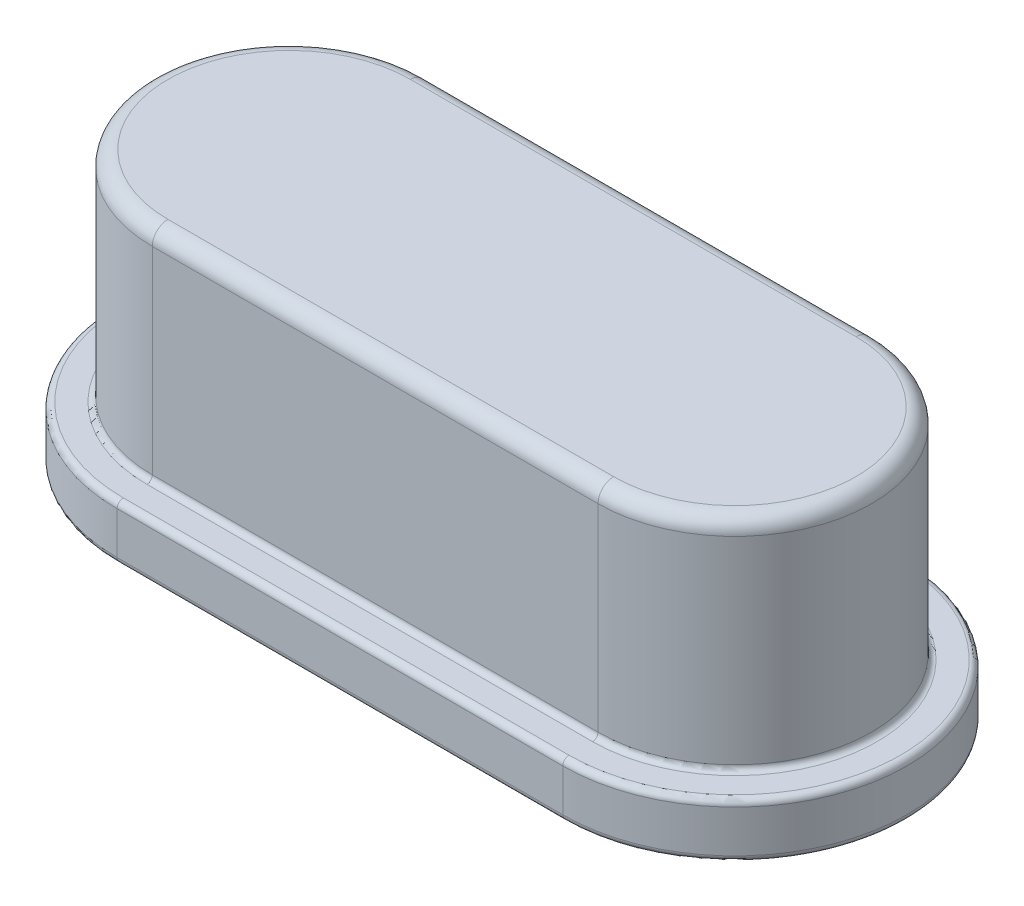
ISO-10303-21;
HEADER;
FILE_DESCRIPTION(('STEP AP214'),'2;1');
FILE_NAME('part.step','',(''),(''),'','','');
FILE_SCHEMA(('AUTOMOTIVE_DESIGN { 1 0 10303 214 1 1 1 1 }'));
ENDSEC;
DATA;
#1=APPLICATION_CONTEXT('core data for automotive mechanical design processes');
#2=APPLICATION_PROTOCOL_DEFINITION('international standard','automotive_design',2000,#1);
#3=PRODUCT_CONTEXT('',#1,'mechanical');
#4=PRODUCT('Part','Part','',(#3));
#5=PRODUCT_RELATED_PRODUCT_CATEGORY('part','',(#4));
#6=PRODUCT_DEFINITION_FORMATION('','',#4);
#7=PRODUCT_DEFINITION_CONTEXT('part definition',#1,'design');
#8=PRODUCT_DEFINITION('design','',#6,#7);
#9=PRODUCT_DEFINITION_SHAPE('','',#8);
#10=(LENGTH_UNIT() NAMED_UNIT(*) SI_UNIT(.MILLI.,.METRE.));
#11=(NAMED_UNIT(*) PLANE_ANGLE_UNIT() SI_UNIT($,.RADIAN.));
#12=(NAMED_UNIT(*) SI_UNIT($,.STERADIAN.) SOLID_ANGLE_UNIT());
#13=UNCERTAINTY_MEASURE_WITH_UNIT(LENGTH_MEASURE(1.E-05),#10,'distance_accuracy_value','');
#14=(GEOMETRIC_REPRESENTATION_CONTEXT(3) GLOBAL_UNCERTAINTY_ASSIGNED_CONTEXT((#13)) GLOBAL_UNIT_ASSIGNED_CONTEXT((#10,
#11,#12)) REPRESENTATION_CONTEXT('',''));
#15=CARTESIAN_POINT('',(0.,0.,0.));
#16=DIRECTION('',(0.,0.,1.));
#17=DIRECTION('',(1.,0.,0.));
#18=AXIS2_PLACEMENT_3D('',#15,#16,#17);
#19=CARTESIAN_POINT('',(-2.85,0.7,0.));
#20=DIRECTION('',(0.,-1.,0.));
#21=DIRECTION('',(0.,0.,-1.));
#22=AXIS2_PLACEMENT_3D('',#19,#20,#21);
#23=CYLINDRICAL_SURFACE('',#22,2.2);
#24=DIRECTION('',(0.,-1.,0.));
#25=VECTOR('',#24,1.);
#26=CARTESIAN_POINT('',(-2.85,0.7,-2.2));
#27=LINE('',#26,#25);
#28=CARTESIAN_POINT('',(-2.85,0.62,-2.2));
#29=VERTEX_POINT('',#28);
#30=CARTESIAN_POINT('',(-2.85,0.08,-2.2));
#31=VERTEX_POINT('',#30);
#32=EDGE_CURVE('E294',#29,#31,#27,.T.);
#33=ORIENTED_EDGE('',*,*,#32,.T.);
#34=CARTESIAN_POINT('',(-2.85,0.08,0.));
#35=DIRECTION('',(0.,1.,0.));
#36=DIRECTION('',(0.,0.,1.));
#37=AXIS2_PLACEMENT_3D('',#34,#35,#36);
#38=CIRCLE('',#37,2.2);
#39=CARTESIAN_POINT('',(-2.85,0.08,2.2));
#40=VERTEX_POINT('',#39);
#41=EDGE_CURVE('E194',#31,#40,#38,.T.);
#42=ORIENTED_EDGE('',*,*,#41,.T.);
#43=DIRECTION('',(0.,-1.,0.));
#44=VECTOR('',#43,1.);
#45=CARTESIAN_POINT('',(-2.85,0.7,2.2));
#46=LINE('',#45,#44);
#47=CARTESIAN_POINT('',(-2.85,0.62,2.2));
#48=VERTEX_POINT('',#47);
#49=EDGE_CURVE('E168',#48,#40,#46,.T.);
#50=ORIENTED_EDGE('',*,*,#49,.F.);
#51=CARTESIAN_POINT('',(-2.85,0.62,0.));
#52=DIRECTION('',(0.,1.,0.));
#53=DIRECTION('',(0.,0.,1.));
#54=AXIS2_PLACEMENT_3D('',#51,#52,#53);
#55=CIRCLE('',#54,2.2);
#56=EDGE_CURVE('E184',#48,#29,#55,.F.);
#57=ORIENTED_EDGE('',*,*,#56,.T.);
#58=EDGE_LOOP('',(#33,#42,#50,#57));
#59=FACE_BOUND('',#58,.T.);
#60=ADVANCED_FACE('F32',(#59),#23,.T.);
#61=CARTESIAN_POINT('',(-2.85,0.7,2.2));
#62=DIRECTION('',(0.,0.,-1.));
#63=DIRECTION('',(-1.,0.,0.));
#64=AXIS2_PLACEMENT_3D('',#61,#62,#63);
#65=PLANE('',#64);
#66=ORIENTED_EDGE('',*,*,#49,.T.);
#67=DIRECTION('',(1.,0.,0.));
#68=VECTOR('',#67,1.);
#69=CARTESIAN_POINT('',(-2.85,0.08,2.2));
#70=LINE('',#69,#68);
#71=CARTESIAN_POINT('',(2.85,0.08,2.2));
#72=VERTEX_POINT('',#71);
#73=EDGE_CURVE('E225',#40,#72,#70,.T.);
#74=ORIENTED_EDGE('',*,*,#73,.T.);
#75=DIRECTION('',(0.,-1.,0.));
#76=VECTOR('',#75,1.);
#77=CARTESIAN_POINT('',(2.85,0.7,2.2));
#78=LINE('',#77,#76);
#79=CARTESIAN_POINT('',(2.85,0.62,2.2));
#80=VERTEX_POINT('',#79);
#81=EDGE_CURVE('E306',#80,#72,#78,.T.);
#82=ORIENTED_EDGE('',*,*,#81,.F.);
#83=DIRECTION('',(1.,0.,0.));
#84=VECTOR('',#83,1.);
#85=CARTESIAN_POINT('',(-2.85,0.62,2.2));
#86=LINE('',#85,#84);
#87=EDGE_CURVE('E223',#80,#48,#86,.F.);
#88=ORIENTED_EDGE('',*,*,#87,.T.);
#89=EDGE_LOOP('',(#66,#74,#82,#88));
#90=FACE_BOUND('',#89,.T.);
#91=ADVANCED_FACE('F330',(#90),#65,.F.);
#92=CARTESIAN_POINT('',(2.85,0.7,0.));
#93=DIRECTION('',(0.,-1.,0.));
#94=DIRECTION('',(0.,0.,-1.));
#95=AXIS2_PLACEMENT_3D('',#92,#93,#94);
#96=CYLINDRICAL_SURFACE('',#95,2.2);
#97=ORIENTED_EDGE('',*,*,#81,.T.);
#98=CARTESIAN_POINT('',(2.85,0.08,0.));
#99=DIRECTION('',(0.,1.,0.));
#100=DIRECTION('',(0.,0.,1.));
#101=AXIS2_PLACEMENT_3D('',#98,#99,#100);
#102=CIRCLE('',#101,2.2);
#103=CARTESIAN_POINT('',(2.85,0.08,-2.2));
#104=VERTEX_POINT('',#103);
#105=EDGE_CURVE('E212',#72,#104,#102,.T.);
#106=ORIENTED_EDGE('',*,*,#105,.T.);
#107=DIRECTION('',(0.,-1.,0.));
#108=VECTOR('',#107,1.);
#109=CARTESIAN_POINT('',(2.85,0.7,-2.2));
#110=LINE('',#109,#108);
#111=CARTESIAN_POINT('',(2.85,0.62,-2.2));
#112=VERTEX_POINT('',#111);
#113=EDGE_CURVE('E298',#112,#104,#110,.T.);
#114=ORIENTED_EDGE('',*,*,#113,.F.);
#115=CARTESIAN_POINT('',(2.85,0.62,0.));
#116=DIRECTION('',(0.,1.,0.));
#117=DIRECTION('',(0.,0.,1.));
#118=AXIS2_PLACEMENT_3D('',#115,#116,#117);
#119=CIRCLE('',#118,2.2);
#120=EDGE_CURVE('E210',#112,#80,#119,.F.);
#121=ORIENTED_EDGE('',*,*,#120,.T.);
#122=EDGE_LOOP('',(#97,#106,#114,#121));
#123=FACE_BOUND('',#122,.T.);
#124=ADVANCED_FACE('F336',(#123),#96,.T.);
#125=CARTESIAN_POINT('',(-2.85,0.7,-2.2));
#126=DIRECTION('',(0.,0.,1.));
#127=DIRECTION('',(1.,0.,0.));
#128=AXIS2_PLACEMENT_3D('',#125,#126,#127);
#129=PLANE('',#128);
#130=ORIENTED_EDGE('',*,*,#113,.T.);
#131=DIRECTION('',(-1.,0.,0.));
#132=VECTOR('',#131,1.);
#133=CARTESIAN_POINT('',(-2.85,0.08,-2.2));
#134=LINE('',#133,#132);
#135=EDGE_CURVE('E208',#104,#31,#134,.T.);
#136=ORIENTED_EDGE('',*,*,#135,.T.);
#137=ORIENTED_EDGE('',*,*,#32,.F.);
#138=DIRECTION('',(-1.,0.,0.));
#139=VECTOR('',#138,1.);
#140=CARTESIAN_POINT('',(2.85,0.62,-2.2));
#141=LINE('',#140,#139);
#142=EDGE_CURVE('E206',#29,#112,#141,.F.);
#143=ORIENTED_EDGE('',*,*,#142,.T.);
#144=EDGE_LOOP('',(#130,#136,#137,#143));
#145=FACE_BOUND('',#144,.T.);
#146=ADVANCED_FACE('F478',(#145),#129,.F.);
#147=CARTESIAN_POINT('',(-2.85,0.7,0.));
#148=DIRECTION('',(0.,1.,0.));
#149=DIRECTION('',(0.,0.,1.));
#150=AXIS2_PLACEMENT_3D('',#147,#148,#149);
#151=PLANE('',#150);
#152=DIRECTION('',(1.,0.,0.));
#153=VECTOR('',#152,1.);
#154=CARTESIAN_POINT('',(-2.85,0.7,1.82));
#155=LINE('',#154,#153);
#156=CARTESIAN_POINT('',(2.85,0.7,1.82));
#157=VERTEX_POINT('',#156);
#158=CARTESIAN_POINT('',(-2.85,0.7,1.82));
#159=VERTEX_POINT('',#158);
#160=EDGE_CURVE('E249',#157,#159,#155,.F.);
#161=ORIENTED_EDGE('',*,*,#160,.T.);
#162=CARTESIAN_POINT('',(-2.85,0.7,0.));
#163=DIRECTION('',(0.,1.,0.));
#164=DIRECTION('',(0.,0.,1.));
#165=AXIS2_PLACEMENT_3D('',#162,#163,#164);
#166=CIRCLE('',#165,1.82);
#167=CARTESIAN_POINT('',(-2.85,0.7,-1.82));
#168=VERTEX_POINT('',#167);
#169=EDGE_CURVE('E255',#159,#168,#166,.F.);
#170=ORIENTED_EDGE('',*,*,#169,.T.);
#171=DIRECTION('',(-1.,0.,0.));
#172=VECTOR('',#171,1.);
#173=CARTESIAN_POINT('',(-2.85,0.7,-1.82));
#174=LINE('',#173,#172);
#175=CARTESIAN_POINT('',(2.85,0.7,-1.82));
#176=VERTEX_POINT('',#175);
#177=EDGE_CURVE('E253',#168,#176,#174,.F.);
#178=ORIENTED_EDGE('',*,*,#177,.T.);
#179=CARTESIAN_POINT('',(2.85,0.7,0.));
#180=DIRECTION('',(0.,1.,0.));
#181=DIRECTION('',(0.,0.,1.));
#182=AXIS2_PLACEMENT_3D('',#179,#180,#181);
#183=CIRCLE('',#182,1.82);
#184=EDGE_CURVE('E251',#176,#157,#183,.F.);
#185=ORIENTED_EDGE('',*,*,#184,.T.);
#186=EDGE_LOOP('',(#161,#170,#178,#185));
#187=FACE_BOUND('',#186,.T.);
#188=DIRECTION('',(-1.,0.,0.));
#189=VECTOR('',#188,1.);
#190=CARTESIAN_POINT('',(-2.85,0.7,-2.12));
#191=LINE('',#190,#189);
#192=CARTESIAN_POINT('',(2.85,0.7,-2.12));
#193=VERTEX_POINT('',#192);
#194=CARTESIAN_POINT('',(-2.85,0.7,-2.12));
#195=VERTEX_POINT('',#194);
#196=EDGE_CURVE('E218',#193,#195,#191,.T.);
#197=ORIENTED_EDGE('',*,*,#196,.T.);
#198=CARTESIAN_POINT('',(-2.85,0.7,0.));
#199=DIRECTION('',(0.,1.,0.));
#200=DIRECTION('',(0.,0.,1.));
#201=AXIS2_PLACEMENT_3D('',#198,#199,#200);
#202=CIRCLE('',#201,2.12);
#203=CARTESIAN_POINT('',(-2.85,0.7,2.12));
#204=VERTEX_POINT('',#203);
#205=EDGE_CURVE('E220',#195,#204,#202,.T.);
#206=ORIENTED_EDGE('',*,*,#205,.T.);
#207=DIRECTION('',(1.,0.,0.));
#208=VECTOR('',#207,1.);
#209=CARTESIAN_POINT('',(2.85,0.7,2.12));
#210=LINE('',#209,#208);
#211=CARTESIAN_POINT('',(2.85,0.7,2.12));
#212=VERTEX_POINT('',#211);
#213=EDGE_CURVE('E214',#204,#212,#210,.T.);
#214=ORIENTED_EDGE('',*,*,#213,.T.);
#215=CARTESIAN_POINT('',(2.85,0.7,0.));
#216=DIRECTION('',(0.,1.,0.));
#217=DIRECTION('',(0.,0.,1.));
#218=AXIS2_PLACEMENT_3D('',#215,#216,#217);
#219=CIRCLE('',#218,2.12);
#220=EDGE_CURVE('E216',#212,#193,#219,.T.);
#221=ORIENTED_EDGE('',*,*,#220,.T.);
#222=EDGE_LOOP('',(#197,#206,#214,#221));
#223=FACE_BOUND('',#222,.T.);
#224=ADVANCED_FACE('F279',(#187,#223),#151,.T.);
#225=CARTESIAN_POINT('',(-2.85,0.,0.));
#226=DIRECTION('',(0.,1.,0.));
#227=DIRECTION('',(0.,0.,1.));
#228=AXIS2_PLACEMENT_3D('',#225,#226,#227);
#229=PLANE('',#228);
#230=DIRECTION('',(1.,0.,0.));
#231=VECTOR('',#230,1.);
#232=CARTESIAN_POINT('',(-2.85,0.,2.12));
#233=LINE('',#232,#231);
#234=CARTESIAN_POINT('',(2.85,0.,2.12));
#235=VERTEX_POINT('',#234);
#236=CARTESIAN_POINT('',(-2.85,0.,2.12));
#237=VERTEX_POINT('',#236);
#238=EDGE_CURVE('E197',#235,#237,#233,.F.);
#239=ORIENTED_EDGE('',*,*,#238,.T.);
#240=CARTESIAN_POINT('',(-2.85,0.,0.));
#241=DIRECTION('',(0.,1.,0.));
#242=DIRECTION('',(0.,0.,1.));
#243=AXIS2_PLACEMENT_3D('',#240,#241,#242);
#244=CIRCLE('',#243,2.12);
#245=CARTESIAN_POINT('',(-2.85,0.,-2.12));
#246=VERTEX_POINT('',#245);
#247=EDGE_CURVE('E203',#237,#246,#244,.F.);
#248=ORIENTED_EDGE('',*,*,#247,.T.);
#249=DIRECTION('',(-1.,0.,0.));
#250=VECTOR('',#249,1.);
#251=CARTESIAN_POINT('',(-2.85,0.,-2.12));
#252=LINE('',#251,#250);
#253=CARTESIAN_POINT('',(2.85,0.,-2.12));
#254=VERTEX_POINT('',#253);
#255=EDGE_CURVE('E201',#246,#254,#252,.F.);
#256=ORIENTED_EDGE('',*,*,#255,.T.);
#257=CARTESIAN_POINT('',(2.85,0.,0.));
#258=DIRECTION('',(0.,1.,0.));
#259=DIRECTION('',(0.,0.,1.));
#260=AXIS2_PLACEMENT_3D('',#257,#258,#259);
#261=CIRCLE('',#260,2.12);
#262=EDGE_CURVE('E199',#254,#235,#261,.F.);
#263=ORIENTED_EDGE('',*,*,#262,.T.);
#264=EDGE_LOOP('',(#239,#248,#256,#263));
#265=FACE_BOUND('',#264,.T.);
#266=ADVANCED_FACE('F468',(#265),#229,.F.);
#267=CARTESIAN_POINT('',(-2.85,3.5,0.));
#268=DIRECTION('',(0.,-1.,0.));
#269=DIRECTION('',(0.,0.,-1.));
#270=AXIS2_PLACEMENT_3D('',#267,#268,#269);
#271=CYLINDRICAL_SURFACE('',#270,1.75);
#272=DIRECTION('',(0.,-1.,0.));
#273=VECTOR('',#272,1.);
#274=CARTESIAN_POINT('',(-2.85,3.5,-1.75));
#275=LINE('',#274,#273);
#276=CARTESIAN_POINT('',(-2.85,3.3,-1.75));
#277=VERTEX_POINT('',#276);
#278=CARTESIAN_POINT('',(-2.85,0.77,-1.75));
#279=VERTEX_POINT('',#278);
#280=EDGE_CURVE('E191',#277,#279,#275,.T.);
#281=ORIENTED_EDGE('',*,*,#280,.T.);
#282=CARTESIAN_POINT('',(-2.85,0.77,0.));
#283=DIRECTION('',(0.,1.,0.));
#284=DIRECTION('',(0.,0.,1.));
#285=AXIS2_PLACEMENT_3D('',#282,#283,#284);
#286=CIRCLE('',#285,1.75);
#287=CARTESIAN_POINT('',(-2.85,0.77,1.75));
#288=VERTEX_POINT('',#287);
#289=EDGE_CURVE('E227',#279,#288,#286,.T.);
#290=ORIENTED_EDGE('',*,*,#289,.T.);
#291=DIRECTION('',(0.,-1.,0.));
#292=VECTOR('',#291,1.);
#293=CARTESIAN_POINT('',(-2.85,3.5,1.75));
#294=LINE('',#293,#292);
#295=CARTESIAN_POINT('',(-2.85,3.3,1.75));
#296=VERTEX_POINT('',#295);
#297=EDGE_CURVE('E291',#296,#288,#294,.T.);
#298=ORIENTED_EDGE('',*,*,#297,.F.);
#299=CARTESIAN_POINT('',(-2.85,3.3,0.));
#300=DIRECTION('',(0.,1.,0.));
#301=DIRECTION('',(0.,0.,1.));
#302=AXIS2_PLACEMENT_3D('',#299,#300,#301);
#303=CIRCLE('',#302,1.75);
#304=EDGE_CURVE('E154',#296,#277,#303,.F.);
#305=ORIENTED_EDGE('',*,*,#304,.T.);
#306=EDGE_LOOP('',(#281,#290,#298,#305));
#307=FACE_BOUND('',#306,.T.);
#308=ADVANCED_FACE('F290',(#307),#271,.T.);
#309=CARTESIAN_POINT('',(-2.85,3.5,1.75));
#310=DIRECTION('',(0.,0.,-1.));
#311=DIRECTION('',(-1.,0.,0.));
#312=AXIS2_PLACEMENT_3D('',#309,#310,#311);
#313=PLANE('',#312);
#314=ORIENTED_EDGE('',*,*,#297,.T.);
#315=DIRECTION('',(1.,0.,0.));
#316=VECTOR('',#315,1.);
#317=CARTESIAN_POINT('',(-2.85,0.77,1.75));
#318=LINE('',#317,#316);
#319=CARTESIAN_POINT('',(2.85,0.77,1.75));
#320=VERTEX_POINT('',#319);
#321=EDGE_CURVE('E11',#288,#320,#318,.T.);
#322=ORIENTED_EDGE('',*,*,#321,.T.);
#323=DIRECTION('',(0.,-1.,0.));
#324=VECTOR('',#323,1.);
#325=CARTESIAN_POINT('',(2.85,3.5,1.75));
#326=LINE('',#325,#324);
#327=CARTESIAN_POINT('',(2.85,3.3,1.75));
#328=VERTEX_POINT('',#327);
#329=EDGE_CURVE('E295',#328,#320,#326,.T.);
#330=ORIENTED_EDGE('',*,*,#329,.F.);
#331=DIRECTION('',(1.,0.,0.));
#332=VECTOR('',#331,1.);
#333=CARTESIAN_POINT('',(-2.85,3.3,1.75));
#334=LINE('',#333,#332);
#335=EDGE_CURVE('E183',#328,#296,#334,.F.);
#336=ORIENTED_EDGE('',*,*,#335,.T.);
#337=EDGE_LOOP('',(#314,#322,#330,#336));
#338=FACE_BOUND('',#337,.T.);
#339=ADVANCED_FACE('F293',(#338),#313,.F.);
#340=CARTESIAN_POINT('',(2.85,3.5,0.));
#341=DIRECTION('',(0.,-1.,0.));
#342=DIRECTION('',(0.,0.,-1.));
#343=AXIS2_PLACEMENT_3D('',#340,#341,#342);
#344=CYLINDRICAL_SURFACE('',#343,1.75);
#345=ORIENTED_EDGE('',*,*,#329,.T.);
#346=CARTESIAN_POINT('',(2.85,0.77,0.));
#347=DIRECTION('',(0.,1.,0.));
#348=DIRECTION('',(0.,0.,1.));
#349=AXIS2_PLACEMENT_3D('',#346,#347,#348);
#350=CIRCLE('',#349,1.75);
#351=CARTESIAN_POINT('',(2.85,0.77,-1.75));
#352=VERTEX_POINT('',#351);
#353=EDGE_CURVE('E41',#320,#352,#350,.T.);
#354=ORIENTED_EDGE('',*,*,#353,.T.);
#355=DIRECTION('',(0.,-1.,0.));
#356=VECTOR('',#355,1.);
#357=CARTESIAN_POINT('',(2.85,3.5,-1.75));
#358=LINE('',#357,#356);
#359=CARTESIAN_POINT('',(2.85,3.3,-1.75));
#360=VERTEX_POINT('',#359);
#361=EDGE_CURVE('E300',#360,#352,#358,.T.);
#362=ORIENTED_EDGE('',*,*,#361,.F.);
#363=CARTESIAN_POINT('',(2.85,3.3,0.));
#364=DIRECTION('',(0.,1.,0.));
#365=DIRECTION('',(0.,0.,1.));
#366=AXIS2_PLACEMENT_3D('',#363,#364,#365);
#367=CIRCLE('',#366,1.75);
#368=EDGE_CURVE('E181',#360,#328,#367,.F.);
#369=ORIENTED_EDGE('',*,*,#368,.T.);
#370=EDGE_LOOP('',(#345,#354,#362,#369));
#371=FACE_BOUND('',#370,.T.);
#372=ADVANCED_FACE('F320',(#371),#344,.T.);
#373=CARTESIAN_POINT('',(-2.85,3.5,-1.75));
#374=DIRECTION('',(0.,0.,1.));
#375=DIRECTION('',(1.,0.,0.));
#376=AXIS2_PLACEMENT_3D('',#373,#374,#375);
#377=PLANE('',#376);
#378=ORIENTED_EDGE('',*,*,#361,.T.);
#379=DIRECTION('',(-1.,0.,0.));
#380=VECTOR('',#379,1.);
#381=CARTESIAN_POINT('',(-2.85,0.77,-1.75));
#382=LINE('',#381,#380);
#383=EDGE_CURVE('E258',#352,#279,#382,.T.);
#384=ORIENTED_EDGE('',*,*,#383,.T.);
#385=ORIENTED_EDGE('',*,*,#280,.F.);
#386=DIRECTION('',(-1.,0.,0.));
#387=VECTOR('',#386,1.);
#388=CARTESIAN_POINT('',(2.85,3.3,-1.75));
#389=LINE('',#388,#387);
#390=EDGE_CURVE('E175',#277,#360,#389,.F.);
#391=ORIENTED_EDGE('',*,*,#390,.T.);
#392=EDGE_LOOP('',(#378,#384,#385,#391));
#393=FACE_BOUND('',#392,.T.);
#394=ADVANCED_FACE('F318',(#393),#377,.F.);
#395=CARTESIAN_POINT('',(-2.85,3.5,0.));
#396=DIRECTION('',(0.,1.,0.));
#397=DIRECTION('',(0.,0.,1.));
#398=AXIS2_PLACEMENT_3D('',#395,#396,#397);
#399=PLANE('',#398);
#400=DIRECTION('',(-1.,0.,0.));
#401=VECTOR('',#400,1.);
#402=CARTESIAN_POINT('',(-2.85,3.5,-1.55));
#403=LINE('',#402,#401);
#404=CARTESIAN_POINT('',(2.85,3.5,-1.55));
#405=VERTEX_POINT('',#404);
#406=CARTESIAN_POINT('',(-2.85,3.5,-1.55));
#407=VERTEX_POINT('',#406);
#408=EDGE_CURVE('E172',#405,#407,#403,.T.);
#409=ORIENTED_EDGE('',*,*,#408,.T.);
#410=CARTESIAN_POINT('',(-2.85,3.5,0.));
#411=DIRECTION('',(0.,1.,0.));
#412=DIRECTION('',(0.,0.,1.));
#413=AXIS2_PLACEMENT_3D('',#410,#411,#412);
#414=CIRCLE('',#413,1.55);
#415=CARTESIAN_POINT('',(-2.85,3.5,1.55));
#416=VERTEX_POINT('',#415);
#417=EDGE_CURVE('E152',#407,#416,#414,.T.);
#418=ORIENTED_EDGE('',*,*,#417,.T.);
#419=DIRECTION('',(1.,0.,0.));
#420=VECTOR('',#419,1.);
#421=CARTESIAN_POINT('',(2.85,3.5,1.55));
#422=LINE('',#421,#420);
#423=CARTESIAN_POINT('',(2.85,3.5,1.55));
#424=VERTEX_POINT('',#423);
#425=EDGE_CURVE('E161',#416,#424,#422,.T.);
#426=ORIENTED_EDGE('',*,*,#425,.T.);
#427=CARTESIAN_POINT('',(2.85,3.5,0.));
#428=DIRECTION('',(0.,1.,0.));
#429=DIRECTION('',(0.,0.,1.));
#430=AXIS2_PLACEMENT_3D('',#427,#428,#429);
#431=CIRCLE('',#430,1.55);
#432=EDGE_CURVE('E167',#424,#405,#431,.T.);
#433=ORIENTED_EDGE('',*,*,#432,.T.);
#434=EDGE_LOOP('',(#409,#418,#426,#433));
#435=FACE_BOUND('',#434,.T.);
#436=ADVANCED_FACE('F170',(#435),#399,.T.);
#437=CARTESIAN_POINT('',(2.85,3.3,0.));
#438=DIRECTION('',(0.,1.,0.));
#439=DIRECTION('',(0.,0.,1.));
#440=AXIS2_PLACEMENT_3D('',#437,#438,#439);
#441=TOROIDAL_SURFACE('',#440,1.55,0.2);
#442=CARTESIAN_POINT('',(2.85,3.3,1.55));
#443=DIRECTION('',(-1.,0.,0.));
#444=DIRECTION('',(0.,0.,1.));
#445=AXIS2_PLACEMENT_3D('',#442,#443,#444);
#446=CIRCLE('',#445,0.2);
#447=EDGE_CURVE('E164',#328,#424,#446,.T.);
#448=ORIENTED_EDGE('',*,*,#447,.F.);
#449=ORIENTED_EDGE('',*,*,#368,.F.);
#450=CARTESIAN_POINT('',(2.85,3.3,-1.55));
#451=DIRECTION('',(-1.,0.,0.));
#452=DIRECTION('',(0.,0.,1.));
#453=AXIS2_PLACEMENT_3D('',#450,#451,#452);
#454=CIRCLE('',#453,0.2);
#455=EDGE_CURVE('E188',#405,#360,#454,.T.);
#456=ORIENTED_EDGE('',*,*,#455,.F.);
#457=ORIENTED_EDGE('',*,*,#432,.F.);
#458=EDGE_LOOP('',(#448,#449,#456,#457));
#459=FACE_BOUND('',#458,.T.);
#460=ADVANCED_FACE('F313',(#459),#441,.T.);
#461=CARTESIAN_POINT('',(-2.85,3.3,-1.55));
#462=DIRECTION('',(1.,0.,0.));
#463=DIRECTION('',(0.,0.,-1.));
#464=AXIS2_PLACEMENT_3D('',#461,#462,#463);
#465=CYLINDRICAL_SURFACE('',#464,0.2);
#466=ORIENTED_EDGE('',*,*,#455,.T.);
#467=ORIENTED_EDGE('',*,*,#390,.F.);
#468=CARTESIAN_POINT('',(-2.85,3.3,-1.55));
#469=DIRECTION('',(-1.,0.,0.));
#470=DIRECTION('',(0.,0.,1.));
#471=AXIS2_PLACEMENT_3D('',#468,#469,#470);
#472=CIRCLE('',#471,0.2);
#473=EDGE_CURVE('E157',#407,#277,#472,.T.);
#474=ORIENTED_EDGE('',*,*,#473,.F.);
#475=ORIENTED_EDGE('',*,*,#408,.F.);
#476=EDGE_LOOP('',(#466,#467,#474,#475));
#477=FACE_BOUND('',#476,.T.);
#478=ADVANCED_FACE('F316',(#477),#465,.T.);
#479=CARTESIAN_POINT('',(-2.85,3.3,1.55));
#480=DIRECTION('',(-1.,0.,0.));
#481=DIRECTION('',(0.,0.,1.));
#482=AXIS2_PLACEMENT_3D('',#479,#480,#481);
#483=CYLINDRICAL_SURFACE('',#482,0.2);
#484=ORIENTED_EDGE('',*,*,#447,.T.);
#485=ORIENTED_EDGE('',*,*,#425,.F.);
#486=CARTESIAN_POINT('',(-2.85,3.3,1.55));
#487=DIRECTION('',(-1.,0.,0.));
#488=DIRECTION('',(0.,0.,1.));
#489=AXIS2_PLACEMENT_3D('',#486,#487,#488);
#490=CIRCLE('',#489,0.2);
#491=EDGE_CURVE('E148',#296,#416,#490,.T.);
#492=ORIENTED_EDGE('',*,*,#491,.F.);
#493=ORIENTED_EDGE('',*,*,#335,.F.);
#494=EDGE_LOOP('',(#484,#485,#492,#493));
#495=FACE_BOUND('',#494,.T.);
#496=ADVANCED_FACE('F162',(#495),#483,.T.);
#497=CARTESIAN_POINT('',(-2.85,3.3,0.));
#498=DIRECTION('',(0.,1.,0.));
#499=DIRECTION('',(0.,0.,1.));
#500=AXIS2_PLACEMENT_3D('',#497,#498,#499);
#501=TOROIDAL_SURFACE('',#500,1.55,0.2);
#502=ORIENTED_EDGE('',*,*,#473,.T.);
#503=ORIENTED_EDGE('',*,*,#304,.F.);
#504=ORIENTED_EDGE('',*,*,#491,.T.);
#505=ORIENTED_EDGE('',*,*,#417,.F.);
#506=EDGE_LOOP('',(#502,#503,#504,#505));
#507=FACE_BOUND('',#506,.T.);
#508=ADVANCED_FACE('F150',(#507),#501,.T.);
#509=CARTESIAN_POINT('',(2.85,0.08,0.));
#510=DIRECTION('',(0.,1.,0.));
#511=DIRECTION('',(0.,0.,1.));
#512=AXIS2_PLACEMENT_3D('',#509,#510,#511);
#513=TOROIDAL_SURFACE('',#512,2.12,0.08);
#514=CARTESIAN_POINT('',(2.85,0.08,2.12));
#515=DIRECTION('',(-1.,0.,0.));
#516=DIRECTION('',(0.,0.,1.));
#517=AXIS2_PLACEMENT_3D('',#514,#515,#516);
#518=CIRCLE('',#517,0.08);
#519=EDGE_CURVE('E233',#235,#72,#518,.T.);
#520=ORIENTED_EDGE('',*,*,#519,.F.);
#521=ORIENTED_EDGE('',*,*,#262,.F.);
#522=CARTESIAN_POINT('',(2.85,0.08,-2.12));
#523=DIRECTION('',(-1.,0.,0.));
#524=DIRECTION('',(0.,0.,1.));
#525=AXIS2_PLACEMENT_3D('',#522,#523,#524);
#526=CIRCLE('',#525,0.08);
#527=EDGE_CURVE('E158',#104,#254,#526,.T.);
#528=ORIENTED_EDGE('',*,*,#527,.F.);
#529=ORIENTED_EDGE('',*,*,#105,.F.);
#530=EDGE_LOOP('',(#520,#521,#528,#529));
#531=FACE_BOUND('',#530,.T.);
#532=ADVANCED_FACE('F343',(#531),#513,.T.);
#533=CARTESIAN_POINT('',(-2.85,0.08,-2.12));
#534=DIRECTION('',(-1.,0.,0.));
#535=DIRECTION('',(0.,0.,1.));
#536=AXIS2_PLACEMENT_3D('',#533,#534,#535);
#537=CYLINDRICAL_SURFACE('',#536,0.08);
#538=ORIENTED_EDGE('',*,*,#527,.T.);
#539=ORIENTED_EDGE('',*,*,#255,.F.);
#540=CARTESIAN_POINT('',(-2.85,0.08,-2.12));
#541=DIRECTION('',(-1.,0.,0.));
#542=DIRECTION('',(0.,0.,1.));
#543=AXIS2_PLACEMENT_3D('',#540,#541,#542);
#544=CIRCLE('',#543,0.08);
#545=EDGE_CURVE('E230',#31,#246,#544,.T.);
#546=ORIENTED_EDGE('',*,*,#545,.F.);
#547=ORIENTED_EDGE('',*,*,#135,.F.);
#548=EDGE_LOOP('',(#538,#539,#546,#547));
#549=FACE_BOUND('',#548,.T.);
#550=ADVANCED_FACE('F358',(#549),#537,.T.);
#551=CARTESIAN_POINT('',(-2.85,0.08,2.12));
#552=DIRECTION('',(1.,0.,0.));
#553=DIRECTION('',(0.,0.,-1.));
#554=AXIS2_PLACEMENT_3D('',#551,#552,#553);
#555=CYLINDRICAL_SURFACE('',#554,0.08);
#556=ORIENTED_EDGE('',*,*,#519,.T.);
#557=ORIENTED_EDGE('',*,*,#73,.F.);
#558=CARTESIAN_POINT('',(-2.85,0.08,2.12));
#559=DIRECTION('',(-1.,0.,0.));
#560=DIRECTION('',(0.,0.,1.));
#561=AXIS2_PLACEMENT_3D('',#558,#559,#560);
#562=CIRCLE('',#561,0.08);
#563=EDGE_CURVE('E228',#237,#40,#562,.T.);
#564=ORIENTED_EDGE('',*,*,#563,.F.);
#565=ORIENTED_EDGE('',*,*,#238,.F.);
#566=EDGE_LOOP('',(#556,#557,#564,#565));
#567=FACE_BOUND('',#566,.T.);
#568=ADVANCED_FACE('F354',(#567),#555,.T.);
#569=CARTESIAN_POINT('',(-2.85,0.08,0.));
#570=DIRECTION('',(0.,1.,0.));
#571=DIRECTION('',(0.,0.,1.));
#572=AXIS2_PLACEMENT_3D('',#569,#570,#571);
#573=TOROIDAL_SURFACE('',#572,2.12,0.08);
#574=ORIENTED_EDGE('',*,*,#545,.T.);
#575=ORIENTED_EDGE('',*,*,#247,.F.);
#576=ORIENTED_EDGE('',*,*,#563,.T.);
#577=ORIENTED_EDGE('',*,*,#41,.F.);
#578=EDGE_LOOP('',(#574,#575,#576,#577));
#579=FACE_BOUND('',#578,.T.);
#580=ADVANCED_FACE('F350',(#579),#573,.T.);
#581=CARTESIAN_POINT('',(2.85,0.62,0.));
#582=DIRECTION('',(0.,1.,0.));
#583=DIRECTION('',(0.,0.,1.));
#584=AXIS2_PLACEMENT_3D('',#581,#582,#583);
#585=TOROIDAL_SURFACE('',#584,2.12,0.08);
#586=CARTESIAN_POINT('',(2.85,0.62,2.12));
#587=DIRECTION('',(-1.,0.,0.));
#588=DIRECTION('',(0.,0.,1.));
#589=AXIS2_PLACEMENT_3D('',#586,#587,#588);
#590=CIRCLE('',#589,0.08);
#591=EDGE_CURVE('E242',#80,#212,#590,.T.);
#592=ORIENTED_EDGE('',*,*,#591,.F.);
#593=ORIENTED_EDGE('',*,*,#120,.F.);
#594=CARTESIAN_POINT('',(2.85,0.62,-2.12));
#595=DIRECTION('',(-1.,0.,0.));
#596=DIRECTION('',(0.,0.,1.));
#597=AXIS2_PLACEMENT_3D('',#594,#595,#596);
#598=CIRCLE('',#597,0.08);
#599=EDGE_CURVE('E231',#193,#112,#598,.T.);
#600=ORIENTED_EDGE('',*,*,#599,.F.);
#601=ORIENTED_EDGE('',*,*,#220,.F.);
#602=EDGE_LOOP('',(#592,#593,#600,#601));
#603=FACE_BOUND('',#602,.T.);
#604=ADVANCED_FACE('F353',(#603),#585,.T.);
#605=CARTESIAN_POINT('',(-2.85,0.62,-2.12));
#606=DIRECTION('',(1.,0.,0.));
#607=DIRECTION('',(0.,0.,-1.));
#608=AXIS2_PLACEMENT_3D('',#605,#606,#607);
#609=CYLINDRICAL_SURFACE('',#608,0.08);
#610=ORIENTED_EDGE('',*,*,#599,.T.);
#611=ORIENTED_EDGE('',*,*,#142,.F.);
#612=CARTESIAN_POINT('',(-2.85,0.62,-2.12));
#613=DIRECTION('',(-1.,0.,0.));
#614=DIRECTION('',(0.,0.,1.));
#615=AXIS2_PLACEMENT_3D('',#612,#613,#614);
#616=CIRCLE('',#615,0.08);
#617=EDGE_CURVE('E240',#195,#29,#616,.T.);
#618=ORIENTED_EDGE('',*,*,#617,.F.);
#619=ORIENTED_EDGE('',*,*,#196,.F.);
#620=EDGE_LOOP('',(#610,#611,#618,#619));
#621=FACE_BOUND('',#620,.T.);
#622=ADVANCED_FACE('F373',(#621),#609,.T.);
#623=CARTESIAN_POINT('',(-2.85,0.62,2.12));
#624=DIRECTION('',(-1.,0.,0.));
#625=DIRECTION('',(0.,0.,1.));
#626=AXIS2_PLACEMENT_3D('',#623,#624,#625);
#627=CYLINDRICAL_SURFACE('',#626,0.08);
#628=ORIENTED_EDGE('',*,*,#591,.T.);
#629=ORIENTED_EDGE('',*,*,#213,.F.);
#630=CARTESIAN_POINT('',(-2.85,0.62,2.12));
#631=DIRECTION('',(-1.,0.,0.));
#632=DIRECTION('',(0.,0.,1.));
#633=AXIS2_PLACEMENT_3D('',#630,#631,#632);
#634=CIRCLE('',#633,0.08);
#635=EDGE_CURVE('E238',#48,#204,#634,.T.);
#636=ORIENTED_EDGE('',*,*,#635,.F.);
#637=ORIENTED_EDGE('',*,*,#87,.F.);
#638=EDGE_LOOP('',(#628,#629,#636,#637));
#639=FACE_BOUND('',#638,.T.);
#640=ADVANCED_FACE('F369',(#639),#627,.T.);
#641=CARTESIAN_POINT('',(-2.85,0.62,0.));
#642=DIRECTION('',(0.,1.,0.));
#643=DIRECTION('',(0.,0.,1.));
#644=AXIS2_PLACEMENT_3D('',#641,#642,#643);
#645=TOROIDAL_SURFACE('',#644,2.12,0.08);
#646=ORIENTED_EDGE('',*,*,#617,.T.);
#647=ORIENTED_EDGE('',*,*,#56,.F.);
#648=ORIENTED_EDGE('',*,*,#635,.T.);
#649=ORIENTED_EDGE('',*,*,#205,.F.);
#650=EDGE_LOOP('',(#646,#647,#648,#649));
#651=FACE_BOUND('',#650,.T.);
#652=ADVANCED_FACE('F366',(#651),#645,.T.);
#653=CARTESIAN_POINT('',(2.85,0.77,0.));
#654=DIRECTION('',(0.,1.,0.));
#655=DIRECTION('',(0.,0.,1.));
#656=AXIS2_PLACEMENT_3D('',#653,#654,#655);
#657=TOROIDAL_SURFACE('',#656,1.82,0.07);
#658=CARTESIAN_POINT('',(2.85,0.77,1.82));
#659=DIRECTION('',(1.,0.,0.));
#660=DIRECTION('',(0.,0.,-1.));
#661=AXIS2_PLACEMENT_3D('',#658,#659,#660);
#662=CIRCLE('',#661,0.07);
#663=EDGE_CURVE('E264',#157,#320,#662,.T.);
#664=ORIENTED_EDGE('',*,*,#663,.F.);
#665=ORIENTED_EDGE('',*,*,#184,.F.);
#666=CARTESIAN_POINT('',(2.85,0.77,-1.82));
#667=DIRECTION('',(1.,0.,0.));
#668=DIRECTION('',(0.,0.,-1.));
#669=AXIS2_PLACEMENT_3D('',#666,#667,#668);
#670=CIRCLE('',#669,0.07);
#671=EDGE_CURVE('E36',#352,#176,#670,.T.);
#672=ORIENTED_EDGE('',*,*,#671,.F.);
#673=ORIENTED_EDGE('',*,*,#353,.F.);
#674=EDGE_LOOP('',(#664,#665,#672,#673));
#675=FACE_BOUND('',#674,.T.);
#676=ADVANCED_FACE('F34',(#675),#657,.F.);
#677=CARTESIAN_POINT('',(-2.85,0.77,-1.82));
#678=DIRECTION('',(-1.,0.,0.));
#679=DIRECTION('',(0.,0.,1.));
#680=AXIS2_PLACEMENT_3D('',#677,#678,#679);
#681=CYLINDRICAL_SURFACE('',#680,0.07);
#682=ORIENTED_EDGE('',*,*,#671,.T.);
#683=ORIENTED_EDGE('',*,*,#177,.F.);
#684=CARTESIAN_POINT('',(-2.85,0.77,-1.82));
#685=DIRECTION('',(1.,0.,0.));
#686=DIRECTION('',(0.,0.,-1.));
#687=AXIS2_PLACEMENT_3D('',#684,#685,#686);
#688=CIRCLE('',#687,0.07);
#689=EDGE_CURVE('E263',#279,#168,#688,.T.);
#690=ORIENTED_EDGE('',*,*,#689,.F.);
#691=ORIENTED_EDGE('',*,*,#383,.F.);
#692=EDGE_LOOP('',(#682,#683,#690,#691));
#693=FACE_BOUND('',#692,.T.);
#694=ADVANCED_FACE('F274',(#693),#681,.F.);
#695=CARTESIAN_POINT('',(-2.85,0.77,1.82));
#696=DIRECTION('',(1.,0.,0.));
#697=DIRECTION('',(0.,0.,-1.));
#698=AXIS2_PLACEMENT_3D('',#695,#696,#697);
#699=CYLINDRICAL_SURFACE('',#698,0.07);
#700=ORIENTED_EDGE('',*,*,#663,.T.);
#701=ORIENTED_EDGE('',*,*,#321,.F.);
#702=CARTESIAN_POINT('',(-2.85,0.77,1.82));
#703=DIRECTION('',(1.,0.,0.));
#704=DIRECTION('',(0.,0.,-1.));
#705=AXIS2_PLACEMENT_3D('',#702,#703,#704);
#706=CIRCLE('',#705,0.07);
#707=EDGE_CURVE('E261',#159,#288,#706,.T.);
#708=ORIENTED_EDGE('',*,*,#707,.F.);
#709=ORIENTED_EDGE('',*,*,#160,.F.);
#710=EDGE_LOOP('',(#700,#701,#708,#709));
#711=FACE_BOUND('',#710,.T.);
#712=ADVANCED_FACE('F286',(#711),#699,.F.);
#713=CARTESIAN_POINT('',(-2.85,0.77,0.));
#714=DIRECTION('',(0.,1.,0.));
#715=DIRECTION('',(0.,0.,1.));
#716=AXIS2_PLACEMENT_3D('',#713,#714,#715);
#717=TOROIDAL_SURFACE('',#716,1.82,0.07);
#718=ORIENTED_EDGE('',*,*,#689,.T.);
#719=ORIENTED_EDGE('',*,*,#169,.F.);
#720=ORIENTED_EDGE('',*,*,#707,.T.);
#721=ORIENTED_EDGE('',*,*,#289,.F.);
#722=EDGE_LOOP('',(#718,#719,#720,#721));
#723=FACE_BOUND('',#722,.T.);
#724=ADVANCED_FACE('F284',(#723),#717,.F.);
#725=CLOSED_SHELL('',(#60,#91,#124,#146,#224,#266,#308,#339,#372,#394,#436,#460,#478,#496,#508,
#532,#550,#568,#580,#604,#622,#640,#652,#676,#694,#712,#724));
#726=MANIFOLD_SOLID_BREP('B2',#725);
#727=ADVANCED_BREP_SHAPE_REPRESENTATION('',(#18,#726),#14);
#728=SHAPE_DEFINITION_REPRESENTATION(#9,#727);
ENDSEC;
END-ISO-10303-21;
